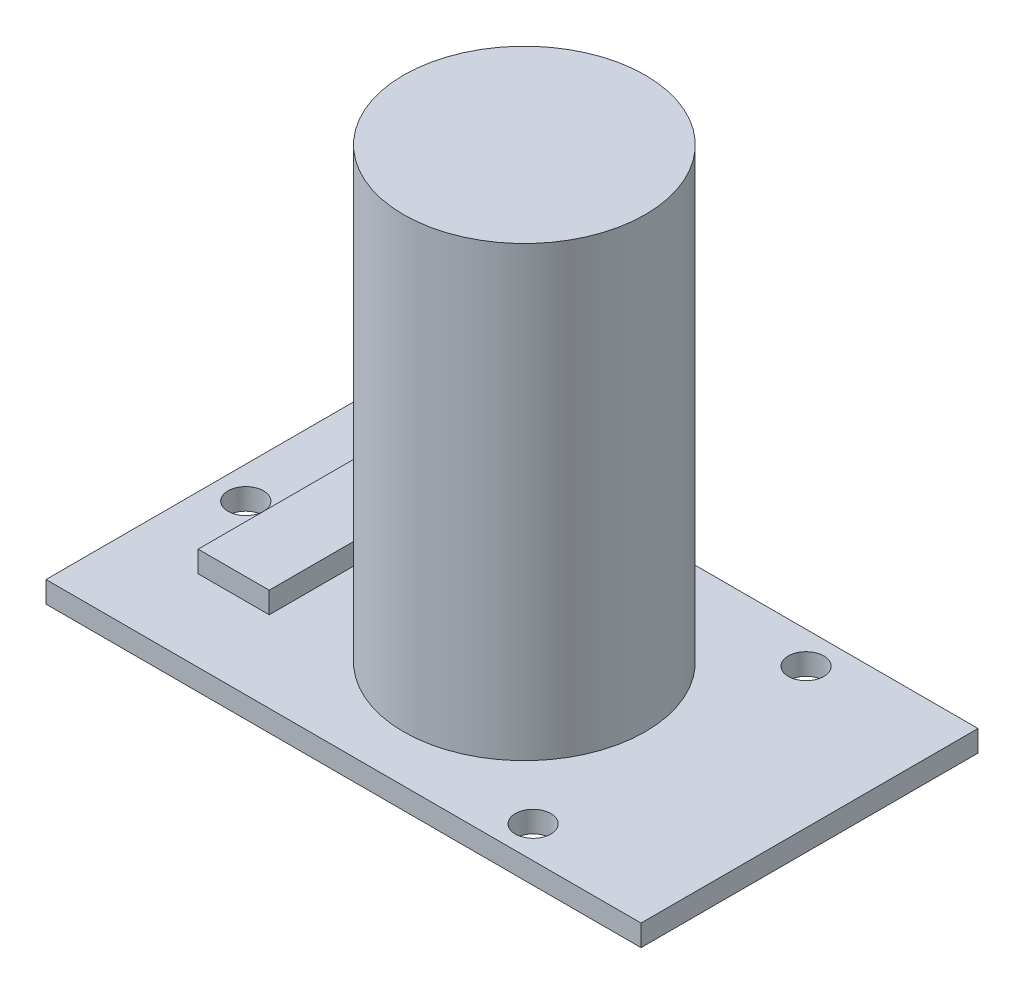
ISO-10303-21;
HEADER;
FILE_DESCRIPTION(('STEP AP214'),'2;1');
FILE_NAME('part.step','',(''),(''),'','','');
FILE_SCHEMA(('AUTOMOTIVE_DESIGN { 1 0 10303 214 1 1 1 1 }'));
ENDSEC;
DATA;
#1=APPLICATION_CONTEXT('core data for automotive mechanical design processes');
#2=APPLICATION_PROTOCOL_DEFINITION('international standard','automotive_design',2000,#1);
#3=PRODUCT_CONTEXT('',#1,'mechanical');
#4=PRODUCT('Part','Part','',(#3));
#5=PRODUCT_RELATED_PRODUCT_CATEGORY('part','',(#4));
#6=PRODUCT_DEFINITION_FORMATION('','',#4);
#7=PRODUCT_DEFINITION_CONTEXT('part definition',#1,'design');
#8=PRODUCT_DEFINITION('design','',#6,#7);
#9=PRODUCT_DEFINITION_SHAPE('','',#8);
#10=(LENGTH_UNIT() NAMED_UNIT(*) SI_UNIT(.MILLI.,.METRE.));
#11=(NAMED_UNIT(*) PLANE_ANGLE_UNIT() SI_UNIT($,.RADIAN.));
#12=(NAMED_UNIT(*) SI_UNIT($,.STERADIAN.) SOLID_ANGLE_UNIT());
#13=UNCERTAINTY_MEASURE_WITH_UNIT(LENGTH_MEASURE(1.E-05),#10,'distance_accuracy_value','');
#14=(GEOMETRIC_REPRESENTATION_CONTEXT(3) GLOBAL_UNCERTAINTY_ASSIGNED_CONTEXT((#13)) GLOBAL_UNIT_ASSIGNED_CONTEXT((#10,
#11,#12)) REPRESENTATION_CONTEXT('',''));
#15=CARTESIAN_POINT('',(0.,0.,0.));
#16=DIRECTION('',(0.,0.,1.));
#17=DIRECTION('',(1.,0.,0.));
#18=AXIS2_PLACEMENT_3D('',#15,#16,#17);
#19=CARTESIAN_POINT('',(0.,1.5,0.));
#20=DIRECTION('',(0.,1.,0.));
#21=DIRECTION('',(0.,0.,1.));
#22=AXIS2_PLACEMENT_3D('',#19,#20,#21);
#23=PLANE('',#22);
#24=CARTESIAN_POINT('',(2.24948874247631,1.5,11.89796245899));
#25=DIRECTION('',(0.,1.,0.));
#26=DIRECTION('',(0.,0.,1.));
#27=AXIS2_PLACEMENT_3D('',#24,#25,#26);
#28=CIRCLE('',#27,1.25);
#29=CARTESIAN_POINT('',(2.24948874247631,1.5,13.14796245899));
#30=VERTEX_POINT('',#29);
#31=EDGE_CURVE('E153',#30,#30,#28,.T.);
#32=ORIENTED_EDGE('',*,*,#31,.F.);
#33=EDGE_LOOP('',(#32));
#34=FACE_BOUND('',#33,.T.);
#35=CARTESIAN_POINT('',(32.01,1.5,21.45));
#36=DIRECTION('',(0.,1.,0.));
#37=DIRECTION('',(0.,0.,1.));
#38=AXIS2_PLACEMENT_3D('',#35,#36,#37);
#39=CIRCLE('',#38,1.25);
#40=CARTESIAN_POINT('',(32.01,1.5,22.7));
#41=VERTEX_POINT('',#40);
#42=EDGE_CURVE('E156',#41,#41,#39,.T.);
#43=ORIENTED_EDGE('',*,*,#42,.F.);
#44=EDGE_LOOP('',(#43));
#45=FACE_BOUND('',#44,.T.);
#46=CARTESIAN_POINT('',(21.85,1.5,11.9023350172504));
#47=DIRECTION('',(0.,1.,0.));
#48=DIRECTION('',(0.,0.,1.));
#49=AXIS2_PLACEMENT_3D('',#46,#47,#48);
#50=CIRCLE('',#49,8.50000000000001);
#51=CARTESIAN_POINT('',(21.85,1.5,20.4023350172504));
#52=VERTEX_POINT('',#51);
#53=EDGE_CURVE('E160',#52,#52,#50,.T.);
#54=ORIENTED_EDGE('',*,*,#53,.F.);
#55=EDGE_LOOP('',(#54));
#56=FACE_BOUND('',#55,.T.);
#57=CARTESIAN_POINT('',(32.01,1.5,2.25));
#58=DIRECTION('',(0.,1.,0.));
#59=DIRECTION('',(0.,0.,1.));
#60=AXIS2_PLACEMENT_3D('',#57,#58,#59);
#61=CIRCLE('',#60,1.25);
#62=CARTESIAN_POINT('',(32.01,1.5,3.5));
#63=VERTEX_POINT('',#62);
#64=EDGE_CURVE('E163',#63,#63,#61,.T.);
#65=ORIENTED_EDGE('',*,*,#64,.F.);
#66=EDGE_LOOP('',(#65));
#67=FACE_BOUND('',#66,.T.);
#68=DIRECTION('',(0.,0.,1.));
#69=VECTOR('',#68,1.);
#70=CARTESIAN_POINT('',(41.85,1.5,0.));
#71=LINE('',#70,#69);
#72=CARTESIAN_POINT('',(41.85,1.5,0.));
#73=VERTEX_POINT('',#72);
#74=CARTESIAN_POINT('',(41.85,1.5,23.7));
#75=VERTEX_POINT('',#74);
#76=EDGE_CURVE('E166',#73,#75,#71,.T.);
#77=ORIENTED_EDGE('',*,*,#76,.F.);
#78=DIRECTION('',(1.,0.,0.));
#79=VECTOR('',#78,1.);
#80=CARTESIAN_POINT('',(0.,1.5,0.));
#81=LINE('',#80,#79);
#82=CARTESIAN_POINT('',(0.,1.5,0.));
#83=VERTEX_POINT('',#82);
#84=EDGE_CURVE('E169',#83,#73,#81,.T.);
#85=ORIENTED_EDGE('',*,*,#84,.F.);
#86=DIRECTION('',(0.,0.,1.));
#87=VECTOR('',#86,1.);
#88=CARTESIAN_POINT('',(0.,1.5,0.));
#89=LINE('',#88,#87);
#90=CARTESIAN_POINT('',(0.,1.5,23.7));
#91=VERTEX_POINT('',#90);
#92=EDGE_CURVE('E172',#83,#91,#89,.T.);
#93=ORIENTED_EDGE('',*,*,#92,.T.);
#94=DIRECTION('',(1.,0.,0.));
#95=VECTOR('',#94,1.);
#96=CARTESIAN_POINT('',(0.,1.5,23.7));
#97=LINE('',#96,#95);
#98=EDGE_CURVE('E175',#91,#75,#97,.T.);
#99=ORIENTED_EDGE('',*,*,#98,.T.);
#100=EDGE_LOOP('',(#77,#85,#93,#99));
#101=FACE_BOUND('',#100,.T.);
#102=DIRECTION('',(0.,0.,-1.));
#103=VECTOR('',#102,1.);
#104=CARTESIAN_POINT('',(5.,1.5,0.));
#105=LINE('',#104,#103);
#106=CARTESIAN_POINT('',(5.00000000000001,1.5,18.));
#107=VERTEX_POINT('',#106);
#108=CARTESIAN_POINT('',(5.,1.5,6.));
#109=VERTEX_POINT('',#108);
#110=EDGE_CURVE('E69',#107,#109,#105,.T.);
#111=ORIENTED_EDGE('',*,*,#110,.T.);
#112=DIRECTION('',(1.,0.,0.));
#113=VECTOR('',#112,1.);
#114=CARTESIAN_POINT('',(0.,1.5,6.));
#115=LINE('',#114,#113);
#116=CARTESIAN_POINT('',(10.,1.5,6.));
#117=VERTEX_POINT('',#116);
#118=EDGE_CURVE('E12',#109,#117,#115,.T.);
#119=ORIENTED_EDGE('',*,*,#118,.T.);
#120=DIRECTION('',(0.,0.,-1.));
#121=VECTOR('',#120,1.);
#122=CARTESIAN_POINT('',(10.,1.5,0.));
#123=LINE('',#122,#121);
#124=CARTESIAN_POINT('',(10.,1.5,18.));
#125=VERTEX_POINT('',#124);
#126=EDGE_CURVE('E205',#125,#117,#123,.T.);
#127=ORIENTED_EDGE('',*,*,#126,.F.);
#128=DIRECTION('',(1.,0.,0.));
#129=VECTOR('',#128,1.);
#130=CARTESIAN_POINT('',(0.,1.5,18.));
#131=LINE('',#130,#129);
#132=EDGE_CURVE('E79',#107,#125,#131,.T.);
#133=ORIENTED_EDGE('',*,*,#132,.F.);
#134=EDGE_LOOP('',(#111,#119,#127,#133));
#135=FACE_BOUND('',#134,.T.);
#136=ADVANCED_FACE('F61',(#34,#45,#56,#67,#101,#135),#23,.T.);
#137=CARTESIAN_POINT('',(0.,1.5,0.));
#138=DIRECTION('',(0.,0.,-1.));
#139=DIRECTION('',(-1.,0.,0.));
#140=AXIS2_PLACEMENT_3D('',#137,#138,#139);
#141=PLANE('',#140);
#142=DIRECTION('',(1.,0.,0.));
#143=VECTOR('',#142,1.);
#144=CARTESIAN_POINT('',(0.,0.,0.));
#145=LINE('',#144,#143);
#146=CARTESIAN_POINT('',(0.,0.,0.));
#147=VERTEX_POINT('',#146);
#148=CARTESIAN_POINT('',(41.85,0.,0.));
#149=VERTEX_POINT('',#148);
#150=EDGE_CURVE('E189',#147,#149,#145,.T.);
#151=ORIENTED_EDGE('',*,*,#150,.F.);
#152=DIRECTION('',(0.,-1.,0.));
#153=VECTOR('',#152,1.);
#154=CARTESIAN_POINT('',(0.,1.5,0.));
#155=LINE('',#154,#153);
#156=EDGE_CURVE('E201',#83,#147,#155,.T.);
#157=ORIENTED_EDGE('',*,*,#156,.F.);
#158=ORIENTED_EDGE('',*,*,#84,.T.);
#159=DIRECTION('',(0.,-1.,0.));
#160=VECTOR('',#159,1.);
#161=CARTESIAN_POINT('',(41.85,1.5,0.));
#162=LINE('',#161,#160);
#163=EDGE_CURVE('E203',#73,#149,#162,.T.);
#164=ORIENTED_EDGE('',*,*,#163,.T.);
#165=EDGE_LOOP('',(#151,#157,#158,#164));
#166=FACE_BOUND('',#165,.T.);
#167=ADVANCED_FACE('F218',(#166),#141,.T.);
#168=CARTESIAN_POINT('',(0.,1.5,0.));
#169=DIRECTION('',(1.,0.,0.));
#170=DIRECTION('',(0.,0.,-1.));
#171=AXIS2_PLACEMENT_3D('',#168,#169,#170);
#172=PLANE('',#171);
#173=DIRECTION('',(0.,0.,1.));
#174=VECTOR('',#173,1.);
#175=CARTESIAN_POINT('',(0.,0.,0.));
#176=LINE('',#175,#174);
#177=CARTESIAN_POINT('',(0.,0.,23.7));
#178=VERTEX_POINT('',#177);
#179=EDGE_CURVE('E192',#147,#178,#176,.T.);
#180=ORIENTED_EDGE('',*,*,#179,.T.);
#181=DIRECTION('',(0.,-1.,0.));
#182=VECTOR('',#181,1.);
#183=CARTESIAN_POINT('',(0.,1.5,23.7));
#184=LINE('',#183,#182);
#185=EDGE_CURVE('E198',#91,#178,#184,.T.);
#186=ORIENTED_EDGE('',*,*,#185,.F.);
#187=ORIENTED_EDGE('',*,*,#92,.F.);
#188=ORIENTED_EDGE('',*,*,#156,.T.);
#189=EDGE_LOOP('',(#180,#186,#187,#188));
#190=FACE_BOUND('',#189,.T.);
#191=ADVANCED_FACE('F224',(#190),#172,.F.);
#192=CARTESIAN_POINT('',(0.,1.5,23.7));
#193=DIRECTION('',(0.,0.,-1.));
#194=DIRECTION('',(-1.,0.,0.));
#195=AXIS2_PLACEMENT_3D('',#192,#193,#194);
#196=PLANE('',#195);
#197=DIRECTION('',(1.,0.,0.));
#198=VECTOR('',#197,1.);
#199=CARTESIAN_POINT('',(0.,0.,23.7));
#200=LINE('',#199,#198);
#201=CARTESIAN_POINT('',(41.85,0.,23.7));
#202=VERTEX_POINT('',#201);
#203=EDGE_CURVE('E157',#178,#202,#200,.T.);
#204=ORIENTED_EDGE('',*,*,#203,.T.);
#205=DIRECTION('',(0.,-1.,0.));
#206=VECTOR('',#205,1.);
#207=CARTESIAN_POINT('',(41.85,1.5,23.7));
#208=LINE('',#207,#206);
#209=EDGE_CURVE('E177',#75,#202,#208,.T.);
#210=ORIENTED_EDGE('',*,*,#209,.F.);
#211=ORIENTED_EDGE('',*,*,#98,.F.);
#212=ORIENTED_EDGE('',*,*,#185,.T.);
#213=EDGE_LOOP('',(#204,#210,#211,#212));
#214=FACE_BOUND('',#213,.T.);
#215=ADVANCED_FACE('F238',(#214),#196,.F.);
#216=CARTESIAN_POINT('',(41.85,1.5,0.));
#217=DIRECTION('',(1.,0.,0.));
#218=DIRECTION('',(0.,0.,-1.));
#219=AXIS2_PLACEMENT_3D('',#216,#217,#218);
#220=PLANE('',#219);
#221=DIRECTION('',(0.,0.,1.));
#222=VECTOR('',#221,1.);
#223=CARTESIAN_POINT('',(41.85,0.,0.));
#224=LINE('',#223,#222);
#225=EDGE_CURVE('E186',#149,#202,#224,.T.);
#226=ORIENTED_EDGE('',*,*,#225,.F.);
#227=ORIENTED_EDGE('',*,*,#163,.F.);
#228=ORIENTED_EDGE('',*,*,#76,.T.);
#229=ORIENTED_EDGE('',*,*,#209,.T.);
#230=EDGE_LOOP('',(#226,#227,#228,#229));
#231=FACE_BOUND('',#230,.T.);
#232=ADVANCED_FACE('F241',(#231),#220,.T.);
#233=CARTESIAN_POINT('',(32.01,1.5,2.25));
#234=DIRECTION('',(0.,-1.,0.));
#235=DIRECTION('',(0.,0.,-1.));
#236=AXIS2_PLACEMENT_3D('',#233,#234,#235);
#237=CYLINDRICAL_SURFACE('',#236,1.25);
#238=ORIENTED_EDGE('',*,*,#64,.T.);
#239=EDGE_LOOP('',(#238));
#240=FACE_BOUND('',#239,.T.);
#241=CARTESIAN_POINT('',(32.01,0.,2.25));
#242=DIRECTION('',(0.,1.,0.));
#243=DIRECTION('',(0.,0.,1.));
#244=AXIS2_PLACEMENT_3D('',#241,#242,#243);
#245=CIRCLE('',#244,1.25);
#246=CARTESIAN_POINT('',(32.01,0.,3.5));
#247=VERTEX_POINT('',#246);
#248=EDGE_CURVE('E183',#247,#247,#245,.T.);
#249=ORIENTED_EDGE('',*,*,#248,.F.);
#250=EDGE_LOOP('',(#249));
#251=FACE_BOUND('',#250,.T.);
#252=ADVANCED_FACE('F248',(#240,#251),#237,.F.);
#253=CARTESIAN_POINT('',(32.01,1.5,21.45));
#254=DIRECTION('',(0.,-1.,0.));
#255=DIRECTION('',(0.,0.,-1.));
#256=AXIS2_PLACEMENT_3D('',#253,#254,#255);
#257=CYLINDRICAL_SURFACE('',#256,1.25);
#258=ORIENTED_EDGE('',*,*,#42,.T.);
#259=EDGE_LOOP('',(#258));
#260=FACE_BOUND('',#259,.T.);
#261=CARTESIAN_POINT('',(32.01,0.,21.45));
#262=DIRECTION('',(0.,1.,0.));
#263=DIRECTION('',(0.,0.,1.));
#264=AXIS2_PLACEMENT_3D('',#261,#262,#263);
#265=CIRCLE('',#264,1.25);
#266=CARTESIAN_POINT('',(32.01,0.,22.7));
#267=VERTEX_POINT('',#266);
#268=EDGE_CURVE('E180',#267,#267,#265,.T.);
#269=ORIENTED_EDGE('',*,*,#268,.F.);
#270=EDGE_LOOP('',(#269));
#271=FACE_BOUND('',#270,.T.);
#272=ADVANCED_FACE('F251',(#260,#271),#257,.F.);
#273=CARTESIAN_POINT('',(2.24948874247631,1.5,11.89796245899));
#274=DIRECTION('',(0.,-1.,0.));
#275=DIRECTION('',(0.,0.,-1.));
#276=AXIS2_PLACEMENT_3D('',#273,#274,#275);
#277=CYLINDRICAL_SURFACE('',#276,1.25);
#278=ORIENTED_EDGE('',*,*,#31,.T.);
#279=EDGE_LOOP('',(#278));
#280=FACE_BOUND('',#279,.T.);
#281=CARTESIAN_POINT('',(2.24948874247631,0.,11.89796245899));
#282=DIRECTION('',(0.,1.,0.));
#283=DIRECTION('',(0.,0.,1.));
#284=AXIS2_PLACEMENT_3D('',#281,#282,#283);
#285=CIRCLE('',#284,1.25);
#286=CARTESIAN_POINT('',(2.24948874247631,0.,13.14796245899));
#287=VERTEX_POINT('',#286);
#288=EDGE_CURVE('E147',#287,#287,#285,.T.);
#289=ORIENTED_EDGE('',*,*,#288,.F.);
#290=EDGE_LOOP('',(#289));
#291=FACE_BOUND('',#290,.T.);
#292=ADVANCED_FACE('F63',(#280,#291),#277,.F.);
#293=CARTESIAN_POINT('',(0.,0.,0.));
#294=DIRECTION('',(0.,1.,0.));
#295=DIRECTION('',(0.,0.,1.));
#296=AXIS2_PLACEMENT_3D('',#293,#294,#295);
#297=PLANE('',#296);
#298=ORIENTED_EDGE('',*,*,#225,.T.);
#299=ORIENTED_EDGE('',*,*,#203,.F.);
#300=ORIENTED_EDGE('',*,*,#179,.F.);
#301=ORIENTED_EDGE('',*,*,#150,.T.);
#302=EDGE_LOOP('',(#298,#299,#300,#301));
#303=FACE_BOUND('',#302,.T.);
#304=ORIENTED_EDGE('',*,*,#248,.T.);
#305=EDGE_LOOP('',(#304));
#306=FACE_BOUND('',#305,.T.);
#307=ORIENTED_EDGE('',*,*,#268,.T.);
#308=EDGE_LOOP('',(#307));
#309=FACE_BOUND('',#308,.T.);
#310=ORIENTED_EDGE('',*,*,#288,.T.);
#311=EDGE_LOOP('',(#310));
#312=FACE_BOUND('',#311,.T.);
#313=ADVANCED_FACE('F233',(#303,#306,#309,#312),#297,.F.);
#314=CARTESIAN_POINT('',(0.,33.,0.));
#315=DIRECTION('',(0.,1.,0.));
#316=DIRECTION('',(0.,0.,1.));
#317=AXIS2_PLACEMENT_3D('',#314,#315,#316);
#318=PLANE('',#317);
#319=CARTESIAN_POINT('',(21.85,33.,11.9023350172504));
#320=DIRECTION('',(0.,1.,0.));
#321=DIRECTION('',(0.,0.,1.));
#322=AXIS2_PLACEMENT_3D('',#319,#320,#321);
#323=CIRCLE('',#322,8.50000000000001);
#324=CARTESIAN_POINT('',(21.85,33.,20.4023350172504));
#325=VERTEX_POINT('',#324);
#326=EDGE_CURVE('E144',#325,#325,#323,.T.);
#327=ORIENTED_EDGE('',*,*,#326,.T.);
#328=EDGE_LOOP('',(#327));
#329=FACE_BOUND('',#328,.T.);
#330=ADVANCED_FACE('F236',(#329),#318,.T.);
#331=CARTESIAN_POINT('',(21.85,33.,11.9023350172504));
#332=DIRECTION('',(0.,-1.,0.));
#333=DIRECTION('',(0.,0.,-1.));
#334=AXIS2_PLACEMENT_3D('',#331,#332,#333);
#335=CYLINDRICAL_SURFACE('',#334,8.50000000000001);
#336=ORIENTED_EDGE('',*,*,#53,.T.);
#337=EDGE_LOOP('',(#336));
#338=FACE_BOUND('',#337,.T.);
#339=ORIENTED_EDGE('',*,*,#326,.F.);
#340=EDGE_LOOP('',(#339));
#341=FACE_BOUND('',#340,.T.);
#342=ADVANCED_FACE('F231',(#338,#341),#335,.T.);
#343=CARTESIAN_POINT('',(0.,3.,6.));
#344=DIRECTION('',(0.,0.,1.));
#345=DIRECTION('',(1.,0.,0.));
#346=AXIS2_PLACEMENT_3D('',#343,#344,#345);
#347=PLANE('',#346);
#348=ORIENTED_EDGE('',*,*,#118,.F.);
#349=DIRECTION('',(0.,-1.,0.));
#350=VECTOR('',#349,1.);
#351=CARTESIAN_POINT('',(5.,3.,6.));
#352=LINE('',#351,#350);
#353=CARTESIAN_POINT('',(5.,3.,6.));
#354=VERTEX_POINT('',#353);
#355=EDGE_CURVE('E126',#354,#109,#352,.T.);
#356=ORIENTED_EDGE('',*,*,#355,.F.);
#357=DIRECTION('',(-1.,0.,0.));
#358=VECTOR('',#357,1.);
#359=CARTESIAN_POINT('',(0.,3.,6.));
#360=LINE('',#359,#358);
#361=CARTESIAN_POINT('',(10.,3.,6.));
#362=VERTEX_POINT('',#361);
#363=EDGE_CURVE('E133',#362,#354,#360,.T.);
#364=ORIENTED_EDGE('',*,*,#363,.F.);
#365=DIRECTION('',(0.,-1.,0.));
#366=VECTOR('',#365,1.);
#367=CARTESIAN_POINT('',(10.,3.,6.));
#368=LINE('',#367,#366);
#369=EDGE_CURVE('E213',#362,#117,#368,.T.);
#370=ORIENTED_EDGE('',*,*,#369,.T.);
#371=EDGE_LOOP('',(#348,#356,#364,#370));
#372=FACE_BOUND('',#371,.T.);
#373=ADVANCED_FACE('F143',(#372),#347,.F.);
#374=CARTESIAN_POINT('',(5.,3.,0.));
#375=DIRECTION('',(1.,0.,0.));
#376=DIRECTION('',(0.,0.,-1.));
#377=AXIS2_PLACEMENT_3D('',#374,#375,#376);
#378=PLANE('',#377);
#379=ORIENTED_EDGE('',*,*,#110,.F.);
#380=DIRECTION('',(0.,-1.,0.));
#381=VECTOR('',#380,1.);
#382=CARTESIAN_POINT('',(5.00000000000001,3.,18.));
#383=LINE('',#382,#381);
#384=CARTESIAN_POINT('',(5.00000000000001,3.,18.));
#385=VERTEX_POINT('',#384);
#386=EDGE_CURVE('E128',#385,#107,#383,.T.);
#387=ORIENTED_EDGE('',*,*,#386,.F.);
#388=DIRECTION('',(0.,0.,1.));
#389=VECTOR('',#388,1.);
#390=CARTESIAN_POINT('',(5.,3.,0.));
#391=LINE('',#390,#389);
#392=EDGE_CURVE('E122',#354,#385,#391,.T.);
#393=ORIENTED_EDGE('',*,*,#392,.F.);
#394=ORIENTED_EDGE('',*,*,#355,.T.);
#395=EDGE_LOOP('',(#379,#387,#393,#394));
#396=FACE_BOUND('',#395,.T.);
#397=ADVANCED_FACE('F124',(#396),#378,.F.);
#398=CARTESIAN_POINT('',(0.,3.,18.));
#399=DIRECTION('',(0.,0.,1.));
#400=DIRECTION('',(1.,0.,0.));
#401=AXIS2_PLACEMENT_3D('',#398,#399,#400);
#402=PLANE('',#401);
#403=ORIENTED_EDGE('',*,*,#386,.T.);
#404=ORIENTED_EDGE('',*,*,#132,.T.);
#405=DIRECTION('',(0.,-1.,0.));
#406=VECTOR('',#405,1.);
#407=CARTESIAN_POINT('',(10.,3.,18.));
#408=LINE('',#407,#406);
#409=CARTESIAN_POINT('',(10.,3.,18.));
#410=VERTEX_POINT('',#409);
#411=EDGE_CURVE('E149',#410,#125,#408,.T.);
#412=ORIENTED_EDGE('',*,*,#411,.F.);
#413=DIRECTION('',(-1.,0.,0.));
#414=VECTOR('',#413,1.);
#415=CARTESIAN_POINT('',(0.,3.,18.));
#416=LINE('',#415,#414);
#417=EDGE_CURVE('E132',#410,#385,#416,.T.);
#418=ORIENTED_EDGE('',*,*,#417,.T.);
#419=EDGE_LOOP('',(#403,#404,#412,#418));
#420=FACE_BOUND('',#419,.T.);
#421=ADVANCED_FACE('F210',(#420),#402,.T.);
#422=CARTESIAN_POINT('',(10.,3.,0.));
#423=DIRECTION('',(1.,0.,0.));
#424=DIRECTION('',(0.,0.,-1.));
#425=AXIS2_PLACEMENT_3D('',#422,#423,#424);
#426=PLANE('',#425);
#427=ORIENTED_EDGE('',*,*,#411,.T.);
#428=ORIENTED_EDGE('',*,*,#126,.T.);
#429=ORIENTED_EDGE('',*,*,#369,.F.);
#430=DIRECTION('',(0.,0.,1.));
#431=VECTOR('',#430,1.);
#432=CARTESIAN_POINT('',(10.,3.,0.));
#433=LINE('',#432,#431);
#434=EDGE_CURVE('E139',#362,#410,#433,.T.);
#435=ORIENTED_EDGE('',*,*,#434,.T.);
#436=EDGE_LOOP('',(#427,#428,#429,#435));
#437=FACE_BOUND('',#436,.T.);
#438=ADVANCED_FACE('F212',(#437),#426,.T.);
#439=CARTESIAN_POINT('',(0.,3.,0.));
#440=DIRECTION('',(0.,1.,0.));
#441=DIRECTION('',(0.,0.,1.));
#442=AXIS2_PLACEMENT_3D('',#439,#440,#441);
#443=PLANE('',#442);
#444=ORIENTED_EDGE('',*,*,#363,.T.);
#445=ORIENTED_EDGE('',*,*,#392,.T.);
#446=ORIENTED_EDGE('',*,*,#417,.F.);
#447=ORIENTED_EDGE('',*,*,#434,.F.);
#448=EDGE_LOOP('',(#444,#445,#446,#447));
#449=FACE_BOUND('',#448,.T.);
#450=ADVANCED_FACE('F137',(#449),#443,.T.);
#451=CLOSED_SHELL('',(#136,#167,#191,#215,#232,#252,#272,#292,#313,#330,#342,#373,#397,#421,
#438,#450));
#452=MANIFOLD_SOLID_BREP('B2',#451);
#453=ADVANCED_BREP_SHAPE_REPRESENTATION('',(#18,#452),#14);
#454=SHAPE_DEFINITION_REPRESENTATION(#9,#453);
ENDSEC;
END-ISO-10303-21;
